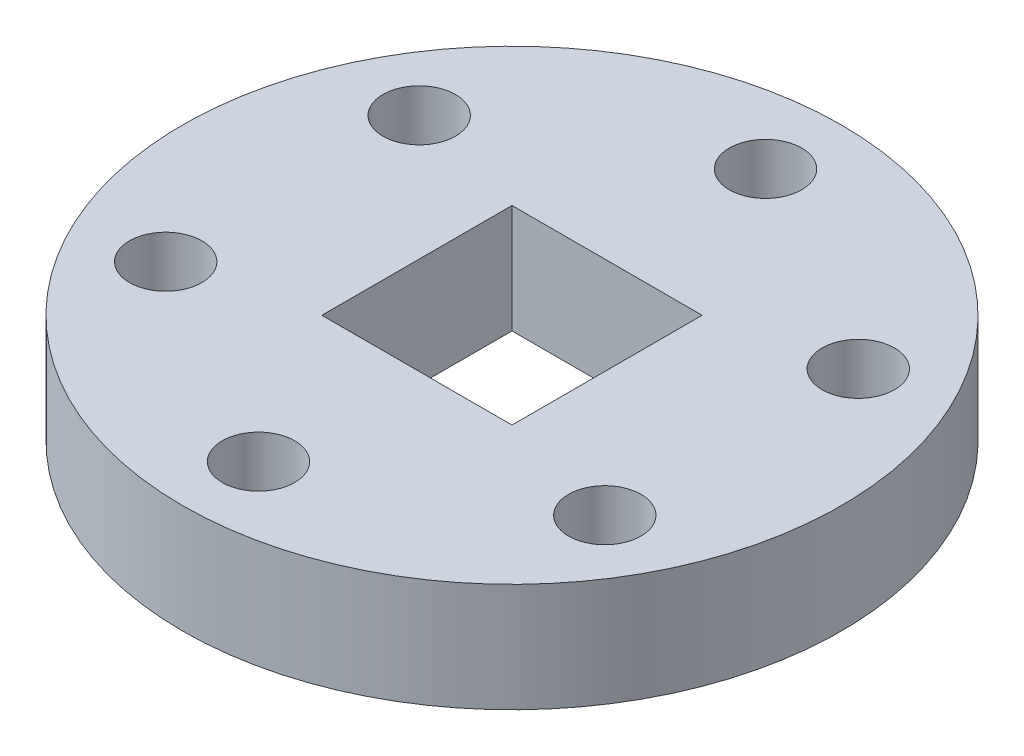
ISO-10303-21;
HEADER;
FILE_DESCRIPTION(('STEP AP214'),'2;1');
FILE_NAME('part.step','',(''),(''),'','','');
FILE_SCHEMA(('AUTOMOTIVE_DESIGN { 1 0 10303 214 1 1 1 1 }'));
ENDSEC;
DATA;
#1=APPLICATION_CONTEXT('core data for automotive mechanical design processes');
#2=APPLICATION_PROTOCOL_DEFINITION('international standard','automotive_design',2000,#1);
#3=PRODUCT_CONTEXT('',#1,'mechanical');
#4=PRODUCT('Part','Part','',(#3));
#5=PRODUCT_RELATED_PRODUCT_CATEGORY('part','',(#4));
#6=PRODUCT_DEFINITION_FORMATION('','',#4);
#7=PRODUCT_DEFINITION_CONTEXT('part definition',#1,'design');
#8=PRODUCT_DEFINITION('design','',#6,#7);
#9=PRODUCT_DEFINITION_SHAPE('','',#8);
#10=(LENGTH_UNIT() NAMED_UNIT(*) SI_UNIT(.MILLI.,.METRE.));
#11=(NAMED_UNIT(*) PLANE_ANGLE_UNIT() SI_UNIT($,.RADIAN.));
#12=(NAMED_UNIT(*) SI_UNIT($,.STERADIAN.) SOLID_ANGLE_UNIT());
#13=UNCERTAINTY_MEASURE_WITH_UNIT(LENGTH_MEASURE(1.E-05),#10,'distance_accuracy_value','');
#14=(GEOMETRIC_REPRESENTATION_CONTEXT(3) GLOBAL_UNCERTAINTY_ASSIGNED_CONTEXT((#13)) GLOBAL_UNIT_ASSIGNED_CONTEXT((#10,
#11,#12)) REPRESENTATION_CONTEXT('',''));
#15=CARTESIAN_POINT('',(0.,0.,0.));
#16=DIRECTION('',(0.,0.,1.));
#17=DIRECTION('',(1.,0.,0.));
#18=AXIS2_PLACEMENT_3D('',#15,#16,#17);
#19=CARTESIAN_POINT('',(0.,6.,0.));
#20=DIRECTION('',(0.,-1.,0.));
#21=DIRECTION('',(0.,0.,-1.));
#22=AXIS2_PLACEMENT_3D('',#19,#20,#21);
#23=CYLINDRICAL_SURFACE('',#22,18.2);
#24=CARTESIAN_POINT('',(0.,6.,0.));
#25=DIRECTION('',(0.,1.,0.));
#26=DIRECTION('',(0.,0.,1.));
#27=AXIS2_PLACEMENT_3D('',#24,#25,#26);
#28=CIRCLE('',#27,18.2);
#29=CARTESIAN_POINT('',(0.,6.,18.2));
#30=VERTEX_POINT('',#29);
#31=EDGE_CURVE('E11',#30,#30,#28,.T.);
#32=ORIENTED_EDGE('',*,*,#31,.F.);
#33=EDGE_LOOP('',(#32));
#34=FACE_BOUND('',#33,.T.);
#35=CARTESIAN_POINT('',(0.,0.,0.));
#36=DIRECTION('',(0.,1.,0.));
#37=DIRECTION('',(0.,0.,1.));
#38=AXIS2_PLACEMENT_3D('',#35,#36,#37);
#39=CIRCLE('',#38,18.2);
#40=CARTESIAN_POINT('',(0.,0.,18.2));
#41=VERTEX_POINT('',#40);
#42=EDGE_CURVE('E39',#41,#41,#39,.T.);
#43=ORIENTED_EDGE('',*,*,#42,.T.);
#44=EDGE_LOOP('',(#43));
#45=FACE_BOUND('',#44,.T.);
#46=ADVANCED_FACE('F36',(#34,#45),#23,.T.);
#47=CARTESIAN_POINT('',(0.,6.,0.));
#48=DIRECTION('',(0.,1.,0.));
#49=DIRECTION('',(0.,0.,1.));
#50=AXIS2_PLACEMENT_3D('',#47,#48,#49);
#51=PLANE('',#50);
#52=DIRECTION('',(0.,0.,1.));
#53=VECTOR('',#52,1.);
#54=CARTESIAN_POINT('',(-5.25,6.,-5.25));
#55=LINE('',#54,#53);
#56=CARTESIAN_POINT('',(-5.25,6.,-5.25));
#57=VERTEX_POINT('',#56);
#58=CARTESIAN_POINT('',(-5.25,6.,5.25));
#59=VERTEX_POINT('',#58);
#60=EDGE_CURVE('E50',#57,#59,#55,.T.);
#61=ORIENTED_EDGE('',*,*,#60,.F.);
#62=DIRECTION('',(1.,0.,0.));
#63=VECTOR('',#62,1.);
#64=CARTESIAN_POINT('',(-5.25,6.,-5.25));
#65=LINE('',#64,#63);
#66=CARTESIAN_POINT('',(5.25,6.,-5.25));
#67=VERTEX_POINT('',#66);
#68=EDGE_CURVE('E92',#57,#67,#65,.T.);
#69=ORIENTED_EDGE('',*,*,#68,.T.);
#70=DIRECTION('',(0.,0.,1.));
#71=VECTOR('',#70,1.);
#72=CARTESIAN_POINT('',(5.25,6.,-5.25));
#73=LINE('',#72,#71);
#74=CARTESIAN_POINT('',(5.25,6.,5.25));
#75=VERTEX_POINT('',#74);
#76=EDGE_CURVE('E95',#67,#75,#73,.T.);
#77=ORIENTED_EDGE('',*,*,#76,.T.);
#78=DIRECTION('',(1.,0.,0.));
#79=VECTOR('',#78,1.);
#80=CARTESIAN_POINT('',(-5.25,6.,5.25));
#81=LINE('',#80,#79);
#82=EDGE_CURVE('E101',#59,#75,#81,.T.);
#83=ORIENTED_EDGE('',*,*,#82,.F.);
#84=EDGE_LOOP('',(#61,#69,#77,#83));
#85=FACE_BOUND('',#84,.T.);
#86=CARTESIAN_POINT('',(0.,6.,-14.));
#87=DIRECTION('',(0.,1.,0.));
#88=DIRECTION('',(0.,0.,1.));
#89=AXIS2_PLACEMENT_3D('',#86,#87,#88);
#90=CIRCLE('',#89,2.);
#91=CARTESIAN_POINT('',(0.,6.,-12.));
#92=VERTEX_POINT('',#91);
#93=EDGE_CURVE('E114',#92,#92,#90,.T.);
#94=ORIENTED_EDGE('',*,*,#93,.F.);
#95=EDGE_LOOP('',(#94));
#96=FACE_BOUND('',#95,.T.);
#97=CARTESIAN_POINT('',(-12.1243556529818,6.,-6.99999999999944));
#98=DIRECTION('',(0.,1.,0.));
#99=DIRECTION('',(0.,0.,1.));
#100=AXIS2_PLACEMENT_3D('',#97,#98,#99);
#101=CIRCLE('',#100,2.);
#102=CARTESIAN_POINT('',(-12.1243556529818,6.,-4.99999999999944));
#103=VERTEX_POINT('',#102);
#104=EDGE_CURVE('E107',#103,#103,#101,.T.);
#105=ORIENTED_EDGE('',*,*,#104,.F.);
#106=EDGE_LOOP('',(#105));
#107=FACE_BOUND('',#106,.T.);
#108=CARTESIAN_POINT('',(-12.1243556529812,6.,7.00000000000056));
#109=DIRECTION('',(0.,1.,0.));
#110=DIRECTION('',(0.,0.,1.));
#111=AXIS2_PLACEMENT_3D('',#108,#109,#110);
#112=CIRCLE('',#111,2.);
#113=CARTESIAN_POINT('',(-12.1243556529812,6.,9.00000000000056));
#114=VERTEX_POINT('',#113);
#115=EDGE_CURVE('E121',#114,#114,#112,.T.);
#116=ORIENTED_EDGE('',*,*,#115,.F.);
#117=EDGE_LOOP('',(#116));
#118=FACE_BOUND('',#117,.T.);
#119=CARTESIAN_POINT('',(1.2733435490921E-12,6.,14.));
#120=DIRECTION('',(0.,1.,0.));
#121=DIRECTION('',(0.,0.,1.));
#122=AXIS2_PLACEMENT_3D('',#119,#120,#121);
#123=CIRCLE('',#122,2.);
#124=CARTESIAN_POINT('',(1.2733435490921E-12,6.,16.));
#125=VERTEX_POINT('',#124);
#126=EDGE_CURVE('E138',#125,#125,#123,.T.);
#127=ORIENTED_EDGE('',*,*,#126,.F.);
#128=EDGE_LOOP('',(#127));
#129=FACE_BOUND('',#128,.T.);
#130=CARTESIAN_POINT('',(12.1243556529831,6.,6.99999999999945));
#131=DIRECTION('',(0.,1.,0.));
#132=DIRECTION('',(0.,0.,1.));
#133=AXIS2_PLACEMENT_3D('',#130,#131,#132);
#134=CIRCLE('',#133,2.);
#135=CARTESIAN_POINT('',(12.1243556529831,6.,8.99999999999945));
#136=VERTEX_POINT('',#135);
#137=EDGE_CURVE('E132',#136,#136,#134,.T.);
#138=ORIENTED_EDGE('',*,*,#137,.F.);
#139=EDGE_LOOP('',(#138));
#140=FACE_BOUND('',#139,.T.);
#141=CARTESIAN_POINT('',(12.1243556529825,6.,-7.00000000000055));
#142=DIRECTION('',(0.,1.,0.));
#143=DIRECTION('',(0.,0.,1.));
#144=AXIS2_PLACEMENT_3D('',#141,#142,#143);
#145=CIRCLE('',#144,2.);
#146=CARTESIAN_POINT('',(12.1243556529825,6.,-5.00000000000055));
#147=VERTEX_POINT('',#146);
#148=EDGE_CURVE('E126',#147,#147,#145,.T.);
#149=ORIENTED_EDGE('',*,*,#148,.F.);
#150=EDGE_LOOP('',(#149));
#151=FACE_BOUND('',#150,.T.);
#152=ORIENTED_EDGE('',*,*,#31,.T.);
#153=EDGE_LOOP('',(#152));
#154=FACE_BOUND('',#153,.T.);
#155=ADVANCED_FACE('F149',(#85,#96,#107,#118,#129,#140,#151,#154),#51,.T.);
#156=CARTESIAN_POINT('',(0.,0.,0.));
#157=DIRECTION('',(0.,1.,0.));
#158=DIRECTION('',(0.,0.,1.));
#159=AXIS2_PLACEMENT_3D('',#156,#157,#158);
#160=PLANE('',#159);
#161=DIRECTION('',(1.,0.,0.));
#162=VECTOR('',#161,1.);
#163=CARTESIAN_POINT('',(-5.25,0.,-5.25));
#164=LINE('',#163,#162);
#165=CARTESIAN_POINT('',(-5.25,0.,-5.25));
#166=VERTEX_POINT('',#165);
#167=CARTESIAN_POINT('',(5.25,0.,-5.25));
#168=VERTEX_POINT('',#167);
#169=EDGE_CURVE('E81',#166,#168,#164,.T.);
#170=ORIENTED_EDGE('',*,*,#169,.F.);
#171=DIRECTION('',(0.,0.,1.));
#172=VECTOR('',#171,1.);
#173=CARTESIAN_POINT('',(-5.25,0.,-5.25));
#174=LINE('',#173,#172);
#175=CARTESIAN_POINT('',(-5.25,0.,5.25));
#176=VERTEX_POINT('',#175);
#177=EDGE_CURVE('E78',#166,#176,#174,.T.);
#178=ORIENTED_EDGE('',*,*,#177,.T.);
#179=DIRECTION('',(1.,0.,0.));
#180=VECTOR('',#179,1.);
#181=CARTESIAN_POINT('',(-5.25,0.,5.25));
#182=LINE('',#181,#180);
#183=CARTESIAN_POINT('',(5.25,0.,5.25));
#184=VERTEX_POINT('',#183);
#185=EDGE_CURVE('E84',#176,#184,#182,.T.);
#186=ORIENTED_EDGE('',*,*,#185,.T.);
#187=DIRECTION('',(0.,0.,1.));
#188=VECTOR('',#187,1.);
#189=CARTESIAN_POINT('',(5.25,0.,-5.25));
#190=LINE('',#189,#188);
#191=EDGE_CURVE('E88',#168,#184,#190,.T.);
#192=ORIENTED_EDGE('',*,*,#191,.F.);
#193=EDGE_LOOP('',(#170,#178,#186,#192));
#194=FACE_BOUND('',#193,.T.);
#195=CARTESIAN_POINT('',(0.,0.,-14.));
#196=DIRECTION('',(0.,1.,0.));
#197=DIRECTION('',(0.,0.,1.));
#198=AXIS2_PLACEMENT_3D('',#195,#196,#197);
#199=CIRCLE('',#198,2.);
#200=CARTESIAN_POINT('',(0.,0.,-12.));
#201=VERTEX_POINT('',#200);
#202=EDGE_CURVE('E111',#201,#201,#199,.T.);
#203=ORIENTED_EDGE('',*,*,#202,.T.);
#204=EDGE_LOOP('',(#203));
#205=FACE_BOUND('',#204,.T.);
#206=CARTESIAN_POINT('',(-12.1243556529818,0.,-6.99999999999944));
#207=DIRECTION('',(0.,1.,0.));
#208=DIRECTION('',(0.,0.,1.));
#209=AXIS2_PLACEMENT_3D('',#206,#207,#208);
#210=CIRCLE('',#209,2.);
#211=CARTESIAN_POINT('',(-12.1243556529818,0.,-4.99999999999944));
#212=VERTEX_POINT('',#211);
#213=EDGE_CURVE('E118',#212,#212,#210,.T.);
#214=ORIENTED_EDGE('',*,*,#213,.T.);
#215=EDGE_LOOP('',(#214));
#216=FACE_BOUND('',#215,.T.);
#217=CARTESIAN_POINT('',(-12.1243556529812,0.,7.00000000000056));
#218=DIRECTION('',(0.,1.,0.));
#219=DIRECTION('',(0.,0.,1.));
#220=AXIS2_PLACEMENT_3D('',#217,#218,#219);
#221=CIRCLE('',#220,2.);
#222=CARTESIAN_POINT('',(-12.1243556529812,0.,9.00000000000056));
#223=VERTEX_POINT('',#222);
#224=EDGE_CURVE('E141',#223,#223,#221,.T.);
#225=ORIENTED_EDGE('',*,*,#224,.T.);
#226=EDGE_LOOP('',(#225));
#227=FACE_BOUND('',#226,.T.);
#228=CARTESIAN_POINT('',(1.2733435490921E-12,0.,14.));
#229=DIRECTION('',(0.,1.,0.));
#230=DIRECTION('',(0.,0.,1.));
#231=AXIS2_PLACEMENT_3D('',#228,#229,#230);
#232=CIRCLE('',#231,2.);
#233=CARTESIAN_POINT('',(1.2733435490921E-12,0.,16.));
#234=VERTEX_POINT('',#233);
#235=EDGE_CURVE('E135',#234,#234,#232,.T.);
#236=ORIENTED_EDGE('',*,*,#235,.T.);
#237=EDGE_LOOP('',(#236));
#238=FACE_BOUND('',#237,.T.);
#239=CARTESIAN_POINT('',(12.1243556529831,0.,6.99999999999945));
#240=DIRECTION('',(0.,1.,0.));
#241=DIRECTION('',(0.,0.,1.));
#242=AXIS2_PLACEMENT_3D('',#239,#240,#241);
#243=CIRCLE('',#242,2.);
#244=CARTESIAN_POINT('',(12.1243556529831,0.,8.99999999999945));
#245=VERTEX_POINT('',#244);
#246=EDGE_CURVE('E129',#245,#245,#243,.T.);
#247=ORIENTED_EDGE('',*,*,#246,.T.);
#248=EDGE_LOOP('',(#247));
#249=FACE_BOUND('',#248,.T.);
#250=CARTESIAN_POINT('',(12.1243556529825,0.,-7.00000000000055));
#251=DIRECTION('',(0.,1.,0.));
#252=DIRECTION('',(0.,0.,1.));
#253=AXIS2_PLACEMENT_3D('',#250,#251,#252);
#254=CIRCLE('',#253,2.);
#255=CARTESIAN_POINT('',(12.1243556529825,0.,-5.00000000000055));
#256=VERTEX_POINT('',#255);
#257=EDGE_CURVE('E117',#256,#256,#254,.T.);
#258=ORIENTED_EDGE('',*,*,#257,.T.);
#259=EDGE_LOOP('',(#258));
#260=FACE_BOUND('',#259,.T.);
#261=ORIENTED_EDGE('',*,*,#42,.F.);
#262=EDGE_LOOP('',(#261));
#263=FACE_BOUND('',#262,.T.);
#264=ADVANCED_FACE('F90',(#194,#205,#216,#227,#238,#249,#260,#263),#160,.F.);
#265=CARTESIAN_POINT('',(12.1243556529825,0.,-7.00000000000055));
#266=DIRECTION('',(0.,1.,0.));
#267=DIRECTION('',(0.,0.,1.));
#268=AXIS2_PLACEMENT_3D('',#265,#266,#267);
#269=CYLINDRICAL_SURFACE('',#268,2.);
#270=ORIENTED_EDGE('',*,*,#257,.F.);
#271=EDGE_LOOP('',(#270));
#272=FACE_BOUND('',#271,.T.);
#273=ORIENTED_EDGE('',*,*,#148,.T.);
#274=EDGE_LOOP('',(#273));
#275=FACE_BOUND('',#274,.T.);
#276=ADVANCED_FACE('F168',(#272,#275),#269,.F.);
#277=CARTESIAN_POINT('',(12.1243556529831,0.,6.99999999999945));
#278=DIRECTION('',(0.,1.,0.));
#279=DIRECTION('',(0.,0.,1.));
#280=AXIS2_PLACEMENT_3D('',#277,#278,#279);
#281=CYLINDRICAL_SURFACE('',#280,2.);
#282=ORIENTED_EDGE('',*,*,#246,.F.);
#283=EDGE_LOOP('',(#282));
#284=FACE_BOUND('',#283,.T.);
#285=ORIENTED_EDGE('',*,*,#137,.T.);
#286=EDGE_LOOP('',(#285));
#287=FACE_BOUND('',#286,.T.);
#288=ADVANCED_FACE('F172',(#284,#287),#281,.F.);
#289=CARTESIAN_POINT('',(1.2733435490921E-12,0.,14.));
#290=DIRECTION('',(0.,1.,0.));
#291=DIRECTION('',(0.,0.,1.));
#292=AXIS2_PLACEMENT_3D('',#289,#290,#291);
#293=CYLINDRICAL_SURFACE('',#292,2.);
#294=ORIENTED_EDGE('',*,*,#235,.F.);
#295=EDGE_LOOP('',(#294));
#296=FACE_BOUND('',#295,.T.);
#297=ORIENTED_EDGE('',*,*,#126,.T.);
#298=EDGE_LOOP('',(#297));
#299=FACE_BOUND('',#298,.T.);
#300=ADVANCED_FACE('F179',(#296,#299),#293,.F.);
#301=CARTESIAN_POINT('',(-12.1243556529812,0.,7.00000000000056));
#302=DIRECTION('',(0.,1.,0.));
#303=DIRECTION('',(0.,0.,1.));
#304=AXIS2_PLACEMENT_3D('',#301,#302,#303);
#305=CYLINDRICAL_SURFACE('',#304,2.);
#306=ORIENTED_EDGE('',*,*,#224,.F.);
#307=EDGE_LOOP('',(#306));
#308=FACE_BOUND('',#307,.T.);
#309=ORIENTED_EDGE('',*,*,#115,.T.);
#310=EDGE_LOOP('',(#309));
#311=FACE_BOUND('',#310,.T.);
#312=ADVANCED_FACE('F147',(#308,#311),#305,.F.);
#313=CARTESIAN_POINT('',(-12.1243556529818,0.,-6.99999999999944));
#314=DIRECTION('',(0.,1.,0.));
#315=DIRECTION('',(0.,0.,1.));
#316=AXIS2_PLACEMENT_3D('',#313,#314,#315);
#317=CYLINDRICAL_SURFACE('',#316,2.);
#318=ORIENTED_EDGE('',*,*,#213,.F.);
#319=EDGE_LOOP('',(#318));
#320=FACE_BOUND('',#319,.T.);
#321=ORIENTED_EDGE('',*,*,#104,.T.);
#322=EDGE_LOOP('',(#321));
#323=FACE_BOUND('',#322,.T.);
#324=ADVANCED_FACE('F178',(#320,#323),#317,.F.);
#325=CARTESIAN_POINT('',(0.,0.,-14.));
#326=DIRECTION('',(0.,1.,0.));
#327=DIRECTION('',(0.,0.,1.));
#328=AXIS2_PLACEMENT_3D('',#325,#326,#327);
#329=CYLINDRICAL_SURFACE('',#328,2.);
#330=ORIENTED_EDGE('',*,*,#202,.F.);
#331=EDGE_LOOP('',(#330));
#332=FACE_BOUND('',#331,.T.);
#333=ORIENTED_EDGE('',*,*,#93,.T.);
#334=EDGE_LOOP('',(#333));
#335=FACE_BOUND('',#334,.T.);
#336=ADVANCED_FACE('F189',(#332,#335),#329,.F.);
#337=CARTESIAN_POINT('',(-5.25,0.,-5.25));
#338=DIRECTION('',(-1.,0.,0.));
#339=DIRECTION('',(0.,0.,1.));
#340=AXIS2_PLACEMENT_3D('',#337,#338,#339);
#341=PLANE('',#340);
#342=ORIENTED_EDGE('',*,*,#60,.T.);
#343=DIRECTION('',(0.,1.,0.));
#344=VECTOR('',#343,1.);
#345=CARTESIAN_POINT('',(-5.25,0.,5.25));
#346=LINE('',#345,#344);
#347=EDGE_CURVE('E75',#176,#59,#346,.T.);
#348=ORIENTED_EDGE('',*,*,#347,.F.);
#349=ORIENTED_EDGE('',*,*,#177,.F.);
#350=DIRECTION('',(0.,1.,0.));
#351=VECTOR('',#350,1.);
#352=CARTESIAN_POINT('',(-5.25,0.,-5.25));
#353=LINE('',#352,#351);
#354=EDGE_CURVE('E105',#166,#57,#353,.T.);
#355=ORIENTED_EDGE('',*,*,#354,.T.);
#356=EDGE_LOOP('',(#342,#348,#349,#355));
#357=FACE_BOUND('',#356,.T.);
#358=ADVANCED_FACE('F76',(#357),#341,.F.);
#359=CARTESIAN_POINT('',(-5.25,0.,-5.25));
#360=DIRECTION('',(0.,0.,1.));
#361=DIRECTION('',(1.,0.,0.));
#362=AXIS2_PLACEMENT_3D('',#359,#360,#361);
#363=PLANE('',#362);
#364=ORIENTED_EDGE('',*,*,#68,.F.);
#365=ORIENTED_EDGE('',*,*,#354,.F.);
#366=ORIENTED_EDGE('',*,*,#169,.T.);
#367=DIRECTION('',(0.,1.,0.));
#368=VECTOR('',#367,1.);
#369=CARTESIAN_POINT('',(5.25,0.,-5.25));
#370=LINE('',#369,#368);
#371=EDGE_CURVE('E108',#168,#67,#370,.T.);
#372=ORIENTED_EDGE('',*,*,#371,.T.);
#373=EDGE_LOOP('',(#364,#365,#366,#372));
#374=FACE_BOUND('',#373,.T.);
#375=ADVANCED_FACE('F196',(#374),#363,.T.);
#376=CARTESIAN_POINT('',(5.25,0.,-5.25));
#377=DIRECTION('',(-1.,0.,0.));
#378=DIRECTION('',(0.,0.,1.));
#379=AXIS2_PLACEMENT_3D('',#376,#377,#378);
#380=PLANE('',#379);
#381=ORIENTED_EDGE('',*,*,#76,.F.);
#382=ORIENTED_EDGE('',*,*,#371,.F.);
#383=ORIENTED_EDGE('',*,*,#191,.T.);
#384=DIRECTION('',(0.,1.,0.));
#385=VECTOR('',#384,1.);
#386=CARTESIAN_POINT('',(5.25,0.,5.25));
#387=LINE('',#386,#385);
#388=EDGE_CURVE('E58',#184,#75,#387,.T.);
#389=ORIENTED_EDGE('',*,*,#388,.T.);
#390=EDGE_LOOP('',(#381,#382,#383,#389));
#391=FACE_BOUND('',#390,.T.);
#392=ADVANCED_FACE('F199',(#391),#380,.T.);
#393=CARTESIAN_POINT('',(-5.25,0.,5.25));
#394=DIRECTION('',(0.,0.,1.));
#395=DIRECTION('',(1.,0.,0.));
#396=AXIS2_PLACEMENT_3D('',#393,#394,#395);
#397=PLANE('',#396);
#398=ORIENTED_EDGE('',*,*,#82,.T.);
#399=ORIENTED_EDGE('',*,*,#388,.F.);
#400=ORIENTED_EDGE('',*,*,#185,.F.);
#401=ORIENTED_EDGE('',*,*,#347,.T.);
#402=EDGE_LOOP('',(#398,#399,#400,#401));
#403=FACE_BOUND('',#402,.T.);
#404=ADVANCED_FACE('F85',(#403),#397,.F.);
#405=CLOSED_SHELL('',(#46,#155,#264,#276,#288,#300,#312,#324,#336,#358,#375,#392,#404));
#406=MANIFOLD_SOLID_BREP('B2',#405);
#407=ADVANCED_BREP_SHAPE_REPRESENTATION('',(#18,#406),#14);
#408=SHAPE_DEFINITION_REPRESENTATION(#9,#407);
ENDSEC;
END-ISO-10303-21;
